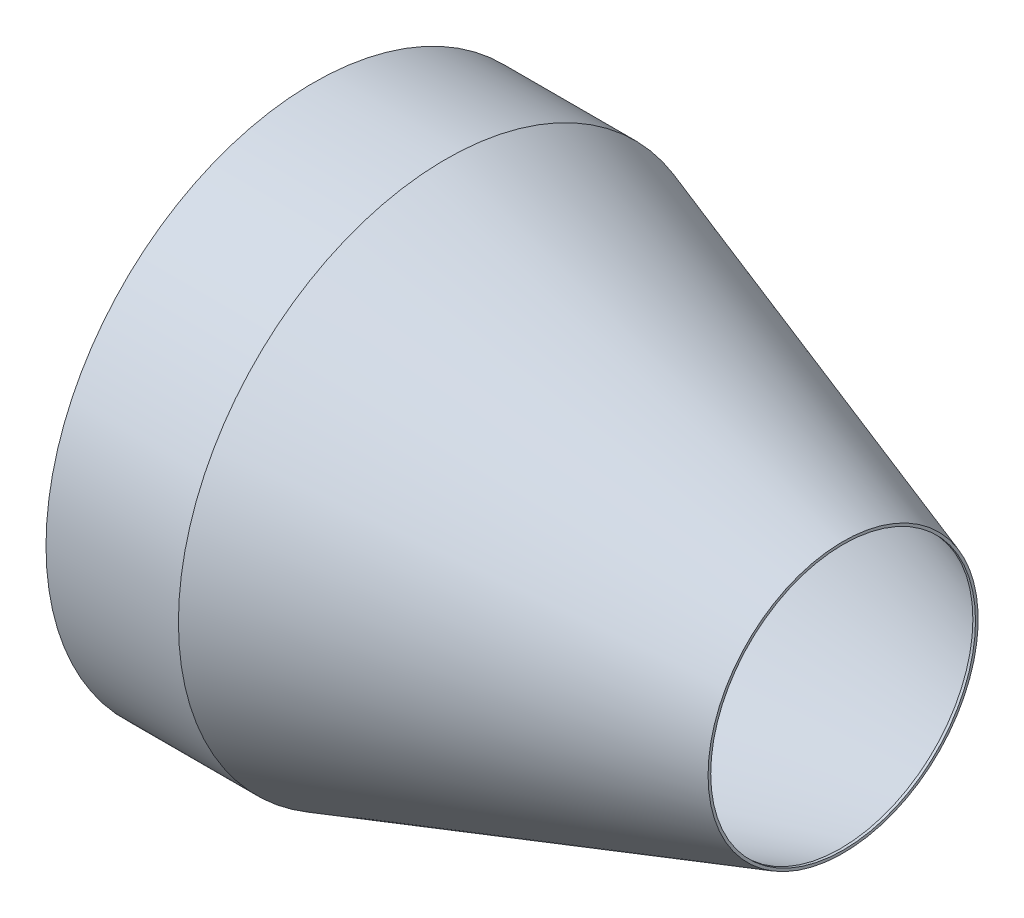
ISO-10303-21;
HEADER;
FILE_DESCRIPTION(('STEP AP214'),'2;1');
FILE_NAME('part.step','',(''),(''),'','','');
FILE_SCHEMA(('AUTOMOTIVE_DESIGN { 1 0 10303 214 1 1 1 1 }'));
ENDSEC;
DATA;
#1=APPLICATION_CONTEXT('core data for automotive mechanical design processes');
#2=APPLICATION_PROTOCOL_DEFINITION('international standard','automotive_design',2000,#1);
#3=PRODUCT_CONTEXT('',#1,'mechanical');
#4=PRODUCT('Part','Part','',(#3));
#5=PRODUCT_RELATED_PRODUCT_CATEGORY('part','',(#4));
#6=PRODUCT_DEFINITION_FORMATION('','',#4);
#7=PRODUCT_DEFINITION_CONTEXT('part definition',#1,'design');
#8=PRODUCT_DEFINITION('design','',#6,#7);
#9=PRODUCT_DEFINITION_SHAPE('','',#8);
#10=(LENGTH_UNIT() NAMED_UNIT(*) SI_UNIT(.MILLI.,.METRE.));
#11=(NAMED_UNIT(*) PLANE_ANGLE_UNIT() SI_UNIT($,.RADIAN.));
#12=(NAMED_UNIT(*) SI_UNIT($,.STERADIAN.) SOLID_ANGLE_UNIT());
#13=UNCERTAINTY_MEASURE_WITH_UNIT(LENGTH_MEASURE(1.E-05),#10,'distance_accuracy_value','');
#14=(GEOMETRIC_REPRESENTATION_CONTEXT(3) GLOBAL_UNCERTAINTY_ASSIGNED_CONTEXT((#13)) GLOBAL_UNIT_ASSIGNED_CONTEXT((#10,
#11,#12)) REPRESENTATION_CONTEXT('',''));
#15=CARTESIAN_POINT('',(0.,0.,0.));
#16=DIRECTION('',(0.,0.,1.));
#17=DIRECTION('',(1.,0.,0.));
#18=AXIS2_PLACEMENT_3D('',#15,#16,#17);
#19=CARTESIAN_POINT('',(0.,101.,0.));
#20=DIRECTION('',(-1.,0.,0.));
#21=DIRECTION('',(0.,0.,1.));
#22=AXIS2_PLACEMENT_3D('',#19,#20,#21);
#23=CYLINDRICAL_SURFACE('',#22,100.);
#24=CARTESIAN_POINT('',(49.8377223398316,101.,0.));
#25=DIRECTION('',(-1.,0.,0.));
#26=DIRECTION('',(0.,0.,1.));
#27=AXIS2_PLACEMENT_3D('',#24,#25,#26);
#28=CIRCLE('',#27,100.);
#29=CARTESIAN_POINT('',(49.8377223398316,101.,100.));
#30=VERTEX_POINT('',#29);
#31=EDGE_CURVE('E10',#30,#30,#28,.T.);
#32=ORIENTED_EDGE('',*,*,#31,.F.);
#33=EDGE_LOOP('',(#32));
#34=FACE_BOUND('',#33,.T.);
#35=CARTESIAN_POINT('',(1.,101.,0.));
#36=DIRECTION('',(-1.,0.,0.));
#37=DIRECTION('',(0.,0.,1.));
#38=AXIS2_PLACEMENT_3D('',#35,#36,#37);
#39=CIRCLE('',#38,100.);
#40=CARTESIAN_POINT('',(1.,101.,100.));
#41=VERTEX_POINT('',#40);
#42=EDGE_CURVE('E52',#41,#41,#39,.T.);
#43=ORIENTED_EDGE('',*,*,#42,.T.);
#44=EDGE_LOOP('',(#43));
#45=FACE_BOUND('',#44,.T.);
#46=ADVANCED_FACE('F41',(#34,#45),#23,.F.);
#47=CARTESIAN_POINT('',(49.8377223398316,101.,0.));
#48=DIRECTION('',(-1.,0.,0.));
#49=DIRECTION('',(0.,0.,1.));
#50=AXIS2_PLACEMENT_3D('',#47,#48,#49);
#51=CONICAL_SURFACE('',#50,100.,0.321750554396642);
#52=CARTESIAN_POINT('',(199.,101.,0.));
#53=DIRECTION('',(-1.,0.,0.));
#54=DIRECTION('',(0.,0.,1.));
#55=AXIS2_PLACEMENT_3D('',#52,#53,#54);
#56=CIRCLE('',#55,50.2792407799439);
#57=CARTESIAN_POINT('',(199.,101.,50.2792407799439));
#58=VERTEX_POINT('',#57);
#59=EDGE_CURVE('E48',#58,#58,#56,.T.);
#60=ORIENTED_EDGE('',*,*,#59,.F.);
#61=EDGE_LOOP('',(#60));
#62=FACE_BOUND('',#61,.T.);
#63=ORIENTED_EDGE('',*,*,#31,.T.);
#64=EDGE_LOOP('',(#63));
#65=FACE_BOUND('',#64,.T.);
#66=ADVANCED_FACE('F101',(#62,#65),#51,.F.);
#67=CARTESIAN_POINT('',(199.,100.,0.));
#68=DIRECTION('',(1.,0.,0.));
#69=DIRECTION('',(0.,0.,-1.));
#70=AXIS2_PLACEMENT_3D('',#67,#68,#69);
#71=PLANE('',#70);
#72=CARTESIAN_POINT('',(199.,101.,0.));
#73=DIRECTION('',(1.,0.,0.));
#74=DIRECTION('',(0.,0.,-1.));
#75=AXIS2_PLACEMENT_3D('',#72,#73,#74);
#76=CIRCLE('',#75,50.);
#77=CARTESIAN_POINT('',(199.,101.,-50.));
#78=VERTEX_POINT('',#77);
#79=EDGE_CURVE('E44',#78,#78,#76,.T.);
#80=ORIENTED_EDGE('',*,*,#79,.T.);
#81=EDGE_LOOP('',(#80));
#82=FACE_BOUND('',#81,.T.);
#83=ORIENTED_EDGE('',*,*,#59,.T.);
#84=EDGE_LOOP('',(#83));
#85=FACE_BOUND('',#84,.T.);
#86=ADVANCED_FACE('F106',(#82,#85),#71,.F.);
#87=CARTESIAN_POINT('',(1.,1.,0.));
#88=DIRECTION('',(-1.,0.,0.));
#89=DIRECTION('',(0.,0.,1.));
#90=AXIS2_PLACEMENT_3D('',#87,#88,#89);
#91=PLANE('',#90);
#92=CARTESIAN_POINT('',(1.,101.,0.));
#93=DIRECTION('',(-1.,0.,0.));
#94=DIRECTION('',(0.,0.,1.));
#95=AXIS2_PLACEMENT_3D('',#92,#93,#94);
#96=CIRCLE('',#95,99.5);
#97=CARTESIAN_POINT('',(1.,101.,99.5));
#98=VERTEX_POINT('',#97);
#99=EDGE_CURVE('E69',#98,#98,#96,.T.);
#100=ORIENTED_EDGE('',*,*,#99,.T.);
#101=EDGE_LOOP('',(#100));
#102=FACE_BOUND('',#101,.T.);
#103=ORIENTED_EDGE('',*,*,#42,.F.);
#104=EDGE_LOOP('',(#103));
#105=FACE_BOUND('',#104,.T.);
#106=ADVANCED_FACE('F111',(#102,#105),#91,.F.);
#107=CARTESIAN_POINT('',(190.,101.,0.));
#108=DIRECTION('',(1.,0.,0.));
#109=DIRECTION('',(0.,0.,-1.));
#110=AXIS2_PLACEMENT_3D('',#107,#108,#109);
#111=CYLINDRICAL_SURFACE('',#110,50.);
#112=CARTESIAN_POINT('',(200.,101.,0.));
#113=DIRECTION('',(1.,0.,0.));
#114=DIRECTION('',(0.,0.,-1.));
#115=AXIS2_PLACEMENT_3D('',#112,#113,#114);
#116=CIRCLE('',#115,50.);
#117=CARTESIAN_POINT('',(200.,101.,-50.));
#118=VERTEX_POINT('',#117);
#119=EDGE_CURVE('E66',#118,#118,#116,.T.);
#120=ORIENTED_EDGE('',*,*,#119,.T.);
#121=EDGE_LOOP('',(#120));
#122=FACE_BOUND('',#121,.T.);
#123=ORIENTED_EDGE('',*,*,#79,.F.);
#124=EDGE_LOOP('',(#123));
#125=FACE_BOUND('',#124,.T.);
#126=ADVANCED_FACE('F83',(#122,#125),#111,.F.);
#127=CARTESIAN_POINT('',(0.,0.,0.));
#128=DIRECTION('',(-1.,0.,0.));
#129=DIRECTION('',(0.,0.,1.));
#130=AXIS2_PLACEMENT_3D('',#127,#128,#129);
#131=PLANE('',#130);
#132=CARTESIAN_POINT('',(0.,101.,0.));
#133=DIRECTION('',(-1.,0.,0.));
#134=DIRECTION('',(0.,0.,1.));
#135=AXIS2_PLACEMENT_3D('',#132,#133,#134);
#136=CIRCLE('',#135,99.5);
#137=CARTESIAN_POINT('',(0.,101.,99.5));
#138=VERTEX_POINT('',#137);
#139=EDGE_CURVE('E72',#138,#138,#136,.T.);
#140=ORIENTED_EDGE('',*,*,#139,.F.);
#141=EDGE_LOOP('',(#140));
#142=FACE_BOUND('',#141,.T.);
#143=CARTESIAN_POINT('',(0.,101.,0.));
#144=DIRECTION('',(-1.,0.,0.));
#145=DIRECTION('',(0.,0.,1.));
#146=AXIS2_PLACEMENT_3D('',#143,#144,#145);
#147=CIRCLE('',#146,101.);
#148=CARTESIAN_POINT('',(0.,101.,101.));
#149=VERTEX_POINT('',#148);
#150=EDGE_CURVE('E63',#149,#149,#147,.T.);
#151=ORIENTED_EDGE('',*,*,#150,.T.);
#152=EDGE_LOOP('',(#151));
#153=FACE_BOUND('',#152,.T.);
#154=ADVANCED_FACE('F79',(#142,#153),#131,.T.);
#155=CARTESIAN_POINT('',(200.,101.,0.));
#156=DIRECTION('',(1.,0.,0.));
#157=DIRECTION('',(0.,0.,-1.));
#158=AXIS2_PLACEMENT_3D('',#155,#156,#157);
#159=PLANE('',#158);
#160=ORIENTED_EDGE('',*,*,#119,.F.);
#161=EDGE_LOOP('',(#160));
#162=FACE_BOUND('',#161,.T.);
#163=CARTESIAN_POINT('',(200.,101.,0.));
#164=DIRECTION('',(-1.,0.,0.));
#165=DIRECTION('',(0.,0.,1.));
#166=AXIS2_PLACEMENT_3D('',#163,#164,#165);
#167=CIRCLE('',#166,51.);
#168=CARTESIAN_POINT('',(200.,101.,51.));
#169=VERTEX_POINT('',#168);
#170=EDGE_CURVE('E57',#169,#169,#167,.T.);
#171=ORIENTED_EDGE('',*,*,#170,.F.);
#172=EDGE_LOOP('',(#171));
#173=FACE_BOUND('',#172,.T.);
#174=ADVANCED_FACE('F82',(#162,#173),#159,.T.);
#175=CARTESIAN_POINT('',(50.,101.,0.));
#176=DIRECTION('',(-1.,0.,0.));
#177=DIRECTION('',(0.,0.,1.));
#178=AXIS2_PLACEMENT_3D('',#175,#176,#177);
#179=CONICAL_SURFACE('',#178,101.,0.321750554396642);
#180=ORIENTED_EDGE('',*,*,#170,.T.);
#181=EDGE_LOOP('',(#180));
#182=FACE_BOUND('',#181,.T.);
#183=CARTESIAN_POINT('',(50.,101.,0.));
#184=DIRECTION('',(-1.,0.,0.));
#185=DIRECTION('',(0.,0.,1.));
#186=AXIS2_PLACEMENT_3D('',#183,#184,#185);
#187=CIRCLE('',#186,101.);
#188=CARTESIAN_POINT('',(50.,101.,101.));
#189=VERTEX_POINT('',#188);
#190=EDGE_CURVE('E60',#189,#189,#187,.T.);
#191=ORIENTED_EDGE('',*,*,#190,.F.);
#192=EDGE_LOOP('',(#191));
#193=FACE_BOUND('',#192,.T.);
#194=ADVANCED_FACE('F89',(#182,#193),#179,.T.);
#195=CARTESIAN_POINT('',(0.,101.,0.));
#196=DIRECTION('',(-1.,0.,0.));
#197=DIRECTION('',(0.,0.,1.));
#198=AXIS2_PLACEMENT_3D('',#195,#196,#197);
#199=CYLINDRICAL_SURFACE('',#198,101.);
#200=ORIENTED_EDGE('',*,*,#190,.T.);
#201=EDGE_LOOP('',(#200));
#202=FACE_BOUND('',#201,.T.);
#203=ORIENTED_EDGE('',*,*,#150,.F.);
#204=EDGE_LOOP('',(#203));
#205=FACE_BOUND('',#204,.T.);
#206=ADVANCED_FACE('F87',(#202,#205),#199,.T.);
#207=CARTESIAN_POINT('',(26.,101.,0.));
#208=DIRECTION('',(-1.,0.,0.));
#209=DIRECTION('',(0.,0.,1.));
#210=AXIS2_PLACEMENT_3D('',#207,#208,#209);
#211=CYLINDRICAL_SURFACE('',#210,99.5);
#212=ORIENTED_EDGE('',*,*,#139,.T.);
#213=EDGE_LOOP('',(#212));
#214=FACE_BOUND('',#213,.T.);
#215=ORIENTED_EDGE('',*,*,#99,.F.);
#216=EDGE_LOOP('',(#215));
#217=FACE_BOUND('',#216,.T.);
#218=ADVANCED_FACE('F76',(#214,#217),#211,.F.);
#219=CLOSED_SHELL('',(#46,#66,#86,#106,#126,#154,#174,#194,#206,#218));
#220=MANIFOLD_SOLID_BREP('B2',#219);
#221=ADVANCED_BREP_SHAPE_REPRESENTATION('',(#18,#220),#14);
#222=SHAPE_DEFINITION_REPRESENTATION(#9,#221);
ENDSEC;
END-ISO-10303-21;
